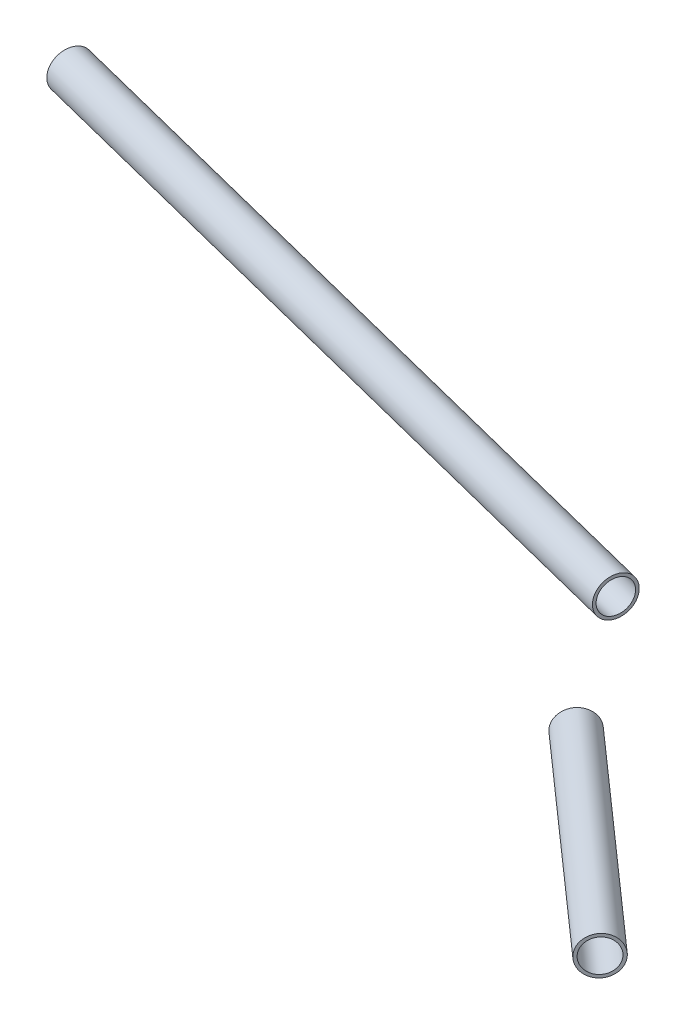
ISO-10303-21;
HEADER;
FILE_DESCRIPTION(('STEP AP214'),'2;1');
FILE_NAME('part.step','',(''),(''),'','','');
FILE_SCHEMA(('AUTOMOTIVE_DESIGN { 1 0 10303 214 1 1 1 1 }'));
ENDSEC;
DATA;
#1=APPLICATION_CONTEXT('core data for automotive mechanical design processes');
#2=APPLICATION_PROTOCOL_DEFINITION('international standard','automotive_design',2000,#1);
#3=PRODUCT_CONTEXT('',#1,'mechanical');
#4=PRODUCT('Part','Part','',(#3));
#5=PRODUCT_RELATED_PRODUCT_CATEGORY('part','',(#4));
#6=PRODUCT_DEFINITION_FORMATION('','',#4);
#7=PRODUCT_DEFINITION_CONTEXT('part definition',#1,'design');
#8=PRODUCT_DEFINITION('design','',#6,#7);
#9=PRODUCT_DEFINITION_SHAPE('','',#8);
#10=(LENGTH_UNIT() NAMED_UNIT(*) SI_UNIT(.MILLI.,.METRE.));
#11=(NAMED_UNIT(*) PLANE_ANGLE_UNIT() SI_UNIT($,.RADIAN.));
#12=(NAMED_UNIT(*) SI_UNIT($,.STERADIAN.) SOLID_ANGLE_UNIT());
#13=UNCERTAINTY_MEASURE_WITH_UNIT(LENGTH_MEASURE(1.E-05),#10,'distance_accuracy_value','');
#14=(GEOMETRIC_REPRESENTATION_CONTEXT(3) GLOBAL_UNCERTAINTY_ASSIGNED_CONTEXT((#13)) GLOBAL_UNIT_ASSIGNED_CONTEXT((#10,
#11,#12)) REPRESENTATION_CONTEXT('',''));
#15=CARTESIAN_POINT('',(0.,0.,0.));
#16=DIRECTION('',(0.,0.,1.));
#17=DIRECTION('',(1.,0.,0.));
#18=AXIS2_PLACEMENT_3D('',#15,#16,#17);
#19=CARTESIAN_POINT('',(-537.221044709369,468.000000002373,235.969292672767));
#20=DIRECTION('',(0.969786100416737,-6.66077807087855E-12,0.24395679830351));
#21=DIRECTION('',(0.24395679830351,0.,-0.969786100416737));
#22=AXIS2_PLACEMENT_3D('',#19,#20,#21);
#23=CYLINDRICAL_SURFACE('',#22,6.34999999762084);
#24=CARTESIAN_POINT('',(-280.044094419269,468.000000000607,300.664038620634));
#25=DIRECTION('',(-0.969786100416737,6.66077807087855E-12,-0.24395679830351));
#26=DIRECTION('',(-0.24395679830351,0.,0.969786100416737));
#27=AXIS2_PLACEMENT_3D('',#24,#25,#26);
#28=CIRCLE('',#27,6.34999999762084);
#29=CARTESIAN_POINT('',(-281.593220087916,468.000000000607,306.822180355973));
#30=VERTEX_POINT('',#29);
#31=EDGE_CURVE('E48',#30,#30,#28,.T.);
#32=ORIENTED_EDGE('',*,*,#31,.T.);
#33=EDGE_LOOP('',(#32));
#34=FACE_BOUND('',#33,.T.);
#35=CARTESIAN_POINT('',(-519.803189587105,468.000000002253,240.350881733608));
#36=DIRECTION('',(-0.969786100416737,6.66077753089505E-12,-0.24395679830351));
#37=DIRECTION('',(-0.24395679830351,0.,0.969786100416737));
#38=AXIS2_PLACEMENT_3D('',#35,#36,#37);
#39=CIRCLE('',#38,6.34999999762084);
#40=CARTESIAN_POINT('',(-521.352315255752,468.000000002253,246.509023468947));
#41=VERTEX_POINT('',#40);
#42=EDGE_CURVE('E11',#41,#41,#39,.T.);
#43=ORIENTED_EDGE('',*,*,#42,.F.);
#44=EDGE_LOOP('',(#43));
#45=FACE_BOUND('',#44,.T.);
#46=ADVANCED_FACE('F41',(#34,#45),#23,.T.);
#47=CARTESIAN_POINT('',(-280.044094419269,468.000000000607,300.664038620634));
#48=DIRECTION('',(-0.969786100416737,6.66077807087855E-12,-0.24395679830351));
#49=DIRECTION('',(-0.24395679830351,0.,0.969786100416737));
#50=AXIS2_PLACEMENT_3D('',#47,#48,#49);
#51=PLANE('',#50);
#52=CARTESIAN_POINT('',(-280.044094419269,468.000000000607,300.664038620634));
#53=DIRECTION('',(-0.969786100416737,6.66077807087855E-12,-0.24395679830351));
#54=DIRECTION('',(-0.24395679830351,0.,0.969786100416737));
#55=AXIS2_PLACEMENT_3D('',#52,#53,#54);
#56=CIRCLE('',#55,5.34999999762084);
#57=CARTESIAN_POINT('',(-281.349263289613,468.000000000607,305.852394255556));
#58=VERTEX_POINT('',#57);
#59=EDGE_CURVE('E56',#58,#58,#56,.T.);
#60=ORIENTED_EDGE('',*,*,#59,.T.);
#61=EDGE_LOOP('',(#60));
#62=FACE_BOUND('',#61,.T.);
#63=ORIENTED_EDGE('',*,*,#31,.F.);
#64=EDGE_LOOP('',(#63));
#65=FACE_BOUND('',#64,.T.);
#66=ADVANCED_FACE('F62',(#62,#65),#51,.F.);
#67=CARTESIAN_POINT('',(-519.751712357219,474.346493123876,240.146247542898));
#68=DIRECTION('',(-0.969786100416737,6.66077753089505E-12,-0.24395679830351));
#69=DIRECTION('',(-0.00810665037571744,-0.999447735688511,0.0322258568046582));
#70=AXIS2_PLACEMENT_3D('',#67,#68,#69);
#71=PLANE('',#70);
#72=CARTESIAN_POINT('',(-519.803189587105,468.000000002253,240.350881733608));
#73=DIRECTION('',(-0.969786100416737,6.66077753089505E-12,-0.24395679830351));
#74=DIRECTION('',(-0.24395679830351,0.,0.969786100416737));
#75=AXIS2_PLACEMENT_3D('',#72,#73,#74);
#76=CIRCLE('',#75,5.34999999762084);
#77=CARTESIAN_POINT('',(-521.108358457448,468.000000002253,245.53923736853));
#78=VERTEX_POINT('',#77);
#79=EDGE_CURVE('E52',#78,#78,#76,.T.);
#80=ORIENTED_EDGE('',*,*,#79,.F.);
#81=EDGE_LOOP('',(#80));
#82=FACE_BOUND('',#81,.T.);
#83=ORIENTED_EDGE('',*,*,#42,.T.);
#84=EDGE_LOOP('',(#83));
#85=FACE_BOUND('',#84,.T.);
#86=ADVANCED_FACE('F43',(#82,#85),#71,.T.);
#87=CARTESIAN_POINT('',(-537.221044709369,468.000000002373,235.969292672767));
#88=DIRECTION('',(0.969786100416737,-6.66077807087855E-12,0.24395679830351));
#89=DIRECTION('',(0.24395679830351,0.,-0.969786100416737));
#90=AXIS2_PLACEMENT_3D('',#87,#88,#89);
#91=CYLINDRICAL_SURFACE('',#90,5.34999999762084);
#92=ORIENTED_EDGE('',*,*,#59,.F.);
#93=EDGE_LOOP('',(#92));
#94=FACE_BOUND('',#93,.T.);
#95=ORIENTED_EDGE('',*,*,#79,.T.);
#96=EDGE_LOOP('',(#95));
#97=FACE_BOUND('',#96,.T.);
#98=ADVANCED_FACE('F65',(#94,#97),#91,.F.);
#99=CLOSED_SHELL('',(#46,#66,#86,#98));
#100=MANIFOLD_SOLID_BREP('B2',#99);
#101=CARTESIAN_POINT('',(-262.05035018698,467.999999999333,333.273520029567));
#102=DIRECTION('',(0.748989028052665,0.,0.662582399295909));
#103=DIRECTION('',(0.662582399295909,0.,-0.748989028052665));
#104=AXIS2_PLACEMENT_3D('',#101,#102,#103);
#105=CYLINDRICAL_SURFACE('',#104,6.34999999625264);
#106=CARTESIAN_POINT('',(-180.316964724346,467.999999999333,405.577787000219));
#107=DIRECTION('',(-0.748989028052666,0.,-0.662582399295909));
#108=DIRECTION('',(-0.662582399295909,0.,0.748989028052666));
#109=AXIS2_PLACEMENT_3D('',#106,#107,#108);
#110=CIRCLE('',#109,6.34999999625264);
#111=CARTESIAN_POINT('',(-184.524362957392,467.999999999333,410.333867325547));
#112=VERTEX_POINT('',#111);
#113=EDGE_CURVE('E110',#112,#112,#110,.T.);
#114=ORIENTED_EDGE('',*,*,#113,.T.);
#115=EDGE_LOOP('',(#114));
#116=FACE_BOUND('',#115,.T.);
#117=CARTESIAN_POINT('',(-248.598123587351,467.999999999333,345.173839316524));
#118=DIRECTION('',(-0.748989028052666,0.,-0.662582399295909));
#119=DIRECTION('',(-0.662582399295909,0.,0.748989028052666));
#120=AXIS2_PLACEMENT_3D('',#117,#118,#119);
#121=CIRCLE('',#120,6.34999999625264);
#122=CARTESIAN_POINT('',(-252.805521820397,467.999999999333,349.929919641851));
#123=VERTEX_POINT('',#122);
#124=EDGE_CURVE('E40',#123,#123,#121,.T.);
#125=ORIENTED_EDGE('',*,*,#124,.F.);
#126=EDGE_LOOP('',(#125));
#127=FACE_BOUND('',#126,.T.);
#128=ADVANCED_FACE('F103',(#116,#127),#105,.T.);
#129=CARTESIAN_POINT('',(-180.316964724346,467.999999999333,405.577787000219));
#130=DIRECTION('',(-0.748989028052666,0.,-0.662582399295909));
#131=DIRECTION('',(-0.662582399295909,0.,0.748989028052666));
#132=AXIS2_PLACEMENT_3D('',#129,#130,#131);
#133=PLANE('',#132);
#134=CARTESIAN_POINT('',(-180.316964724346,467.999999999333,405.577787000219));
#135=DIRECTION('',(-0.748989028052666,0.,-0.662582399295909));
#136=DIRECTION('',(-0.662582399295909,0.,0.748989028052666));
#137=AXIS2_PLACEMENT_3D('',#134,#135,#136);
#138=CIRCLE('',#137,5.34999999625264);
#139=CARTESIAN_POINT('',(-183.861780558096,467.999999999333,409.584878297494));
#140=VERTEX_POINT('',#139);
#141=EDGE_CURVE('E118',#140,#140,#138,.T.);
#142=ORIENTED_EDGE('',*,*,#141,.T.);
#143=EDGE_LOOP('',(#142));
#144=FACE_BOUND('',#143,.T.);
#145=ORIENTED_EDGE('',*,*,#113,.F.);
#146=EDGE_LOOP('',(#145));
#147=FACE_BOUND('',#146,.T.);
#148=ADVANCED_FACE('F124',(#144,#147),#133,.F.);
#149=CARTESIAN_POINT('',(-246.116949418296,462.871676598483,342.369098002409));
#150=DIRECTION('',(-0.748989028052666,0.,-0.662582399295909));
#151=DIRECTION('',(-0.390736089615029,0.807609984385931,0.44169154552981));
#152=AXIS2_PLACEMENT_3D('',#149,#150,#151);
#153=PLANE('',#152);
#154=CARTESIAN_POINT('',(-248.598123587351,467.999999999333,345.173839316524));
#155=DIRECTION('',(-0.748989028052666,0.,-0.662582399295909));
#156=DIRECTION('',(-0.662582399295909,0.,0.748989028052666));
#157=AXIS2_PLACEMENT_3D('',#154,#155,#156);
#158=CIRCLE('',#157,5.34999999625264);
#159=CARTESIAN_POINT('',(-252.142939421101,467.999999999333,349.180930613799));
#160=VERTEX_POINT('',#159);
#161=EDGE_CURVE('E114',#160,#160,#158,.T.);
#162=ORIENTED_EDGE('',*,*,#161,.F.);
#163=EDGE_LOOP('',(#162));
#164=FACE_BOUND('',#163,.T.);
#165=ORIENTED_EDGE('',*,*,#124,.T.);
#166=EDGE_LOOP('',(#165));
#167=FACE_BOUND('',#166,.T.);
#168=ADVANCED_FACE('F105',(#164,#167),#153,.T.);
#169=CARTESIAN_POINT('',(-262.05035018698,467.999999999333,333.273520029567));
#170=DIRECTION('',(0.748989028052665,0.,0.662582399295909));
#171=DIRECTION('',(0.662582399295909,0.,-0.748989028052665));
#172=AXIS2_PLACEMENT_3D('',#169,#170,#171);
#173=CYLINDRICAL_SURFACE('',#172,5.34999999625264);
#174=ORIENTED_EDGE('',*,*,#141,.F.);
#175=EDGE_LOOP('',(#174));
#176=FACE_BOUND('',#175,.T.);
#177=ORIENTED_EDGE('',*,*,#161,.T.);
#178=EDGE_LOOP('',(#177));
#179=FACE_BOUND('',#178,.T.);
#180=ADVANCED_FACE('F127',(#176,#179),#173,.F.);
#181=CLOSED_SHELL('',(#128,#148,#168,#180));
#182=MANIFOLD_SOLID_BREP('B6',#181);
#183=ADVANCED_BREP_SHAPE_REPRESENTATION('',(#18,#100,#182),#14);
#184=SHAPE_DEFINITION_REPRESENTATION(#9,#183);
ENDSEC;
END-ISO-10303-21;
